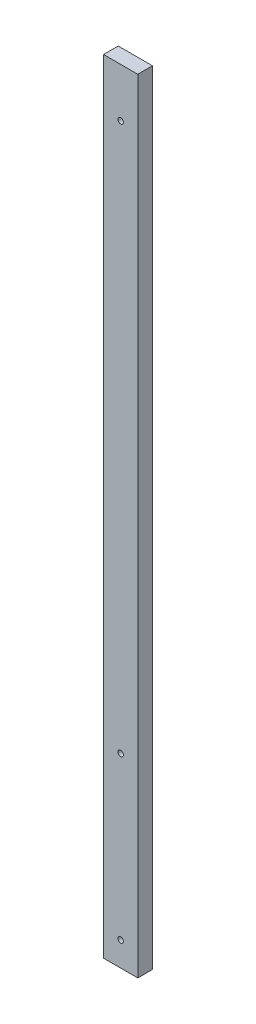
ISO-10303-21;
HEADER;
FILE_DESCRIPTION(('STEP AP214'),'2;1');
FILE_NAME('part.step','',(''),(''),'','','');
FILE_SCHEMA(('AUTOMOTIVE_DESIGN { 1 0 10303 214 1 1 1 1 }'));
ENDSEC;
DATA;
#1=APPLICATION_CONTEXT('core data for automotive mechanical design processes');
#2=APPLICATION_PROTOCOL_DEFINITION('international standard','automotive_design',2000,#1);
#3=PRODUCT_CONTEXT('',#1,'mechanical');
#4=PRODUCT('Part','Part','',(#3));
#5=PRODUCT_RELATED_PRODUCT_CATEGORY('part','',(#4));
#6=PRODUCT_DEFINITION_FORMATION('','',#4);
#7=PRODUCT_DEFINITION_CONTEXT('part definition',#1,'design');
#8=PRODUCT_DEFINITION('design','',#6,#7);
#9=PRODUCT_DEFINITION_SHAPE('','',#8);
#10=(LENGTH_UNIT() NAMED_UNIT(*) SI_UNIT(.MILLI.,.METRE.));
#11=(NAMED_UNIT(*) PLANE_ANGLE_UNIT() SI_UNIT($,.RADIAN.));
#12=(NAMED_UNIT(*) SI_UNIT($,.STERADIAN.) SOLID_ANGLE_UNIT());
#13=UNCERTAINTY_MEASURE_WITH_UNIT(LENGTH_MEASURE(1.E-05),#10,'distance_accuracy_value','');
#14=(GEOMETRIC_REPRESENTATION_CONTEXT(3) GLOBAL_UNCERTAINTY_ASSIGNED_CONTEXT((#13)) GLOBAL_UNIT_ASSIGNED_CONTEXT((#10,
#11,#12)) REPRESENTATION_CONTEXT('',''));
#15=CARTESIAN_POINT('',(0.,0.,0.));
#16=DIRECTION('',(0.,0.,1.));
#17=DIRECTION('',(1.,0.,0.));
#18=AXIS2_PLACEMENT_3D('',#15,#16,#17);
#19=CARTESIAN_POINT('',(-44.45,2032.,19.05));
#20=DIRECTION('',(-1.,0.,0.));
#21=DIRECTION('',(0.,0.,1.));
#22=AXIS2_PLACEMENT_3D('',#19,#20,#21);
#23=PLANE('',#22);
#24=DIRECTION('',(0.,0.,-1.));
#25=VECTOR('',#24,1.);
#26=CARTESIAN_POINT('',(-44.45,0.,19.05));
#27=LINE('',#26,#25);
#28=CARTESIAN_POINT('',(-44.45,0.,19.05));
#29=VERTEX_POINT('',#28);
#30=CARTESIAN_POINT('',(-44.45,0.,-19.05));
#31=VERTEX_POINT('',#30);
#32=EDGE_CURVE('E117',#29,#31,#27,.T.);
#33=ORIENTED_EDGE('',*,*,#32,.F.);
#34=DIRECTION('',(0.,-1.,0.));
#35=VECTOR('',#34,1.);
#36=CARTESIAN_POINT('',(-44.45,2032.,19.05));
#37=LINE('',#36,#35);
#38=CARTESIAN_POINT('',(-44.45,2032.,19.05));
#39=VERTEX_POINT('',#38);
#40=EDGE_CURVE('E11',#39,#29,#37,.T.);
#41=ORIENTED_EDGE('',*,*,#40,.F.);
#42=DIRECTION('',(0.,0.,-1.));
#43=VECTOR('',#42,1.);
#44=CARTESIAN_POINT('',(-44.45,2032.,19.05));
#45=LINE('',#44,#43);
#46=CARTESIAN_POINT('',(-44.45,2032.,-19.05));
#47=VERTEX_POINT('',#46);
#48=EDGE_CURVE('E108',#39,#47,#45,.T.);
#49=ORIENTED_EDGE('',*,*,#48,.T.);
#50=DIRECTION('',(0.,-1.,0.));
#51=VECTOR('',#50,1.);
#52=CARTESIAN_POINT('',(-44.45,2032.,-19.05));
#53=LINE('',#52,#51);
#54=EDGE_CURVE('E47',#47,#31,#53,.T.);
#55=ORIENTED_EDGE('',*,*,#54,.T.);
#56=EDGE_LOOP('',(#33,#41,#49,#55));
#57=FACE_BOUND('',#56,.T.);
#58=ADVANCED_FACE('F44',(#57),#23,.T.);
#59=CARTESIAN_POINT('',(-44.45,2032.,19.05));
#60=DIRECTION('',(0.,0.,-1.));
#61=DIRECTION('',(-1.,0.,0.));
#62=AXIS2_PLACEMENT_3D('',#59,#60,#61);
#63=PLANE('',#62);
#64=CARTESIAN_POINT('',(2.41071722412157E-13,63.4999999999999,19.05));
#65=DIRECTION('',(0.,0.,-1.));
#66=DIRECTION('',(-1.,0.,0.));
#67=AXIS2_PLACEMENT_3D('',#64,#65,#66);
#68=CIRCLE('',#67,7.14375);
#69=CARTESIAN_POINT('',(-7.14374999999976,63.4999999999999,19.05));
#70=VERTEX_POINT('',#69);
#71=EDGE_CURVE('E122',#70,#70,#68,.T.);
#72=ORIENTED_EDGE('',*,*,#71,.T.);
#73=EDGE_LOOP('',(#72));
#74=FACE_BOUND('',#73,.T.);
#75=CARTESIAN_POINT('',(1.89746775059891E-13,482.6,19.05));
#76=DIRECTION('',(0.,0.,-1.));
#77=DIRECTION('',(-1.,0.,0.));
#78=AXIS2_PLACEMENT_3D('',#75,#76,#77);
#79=CIRCLE('',#78,7.14375);
#80=CARTESIAN_POINT('',(-7.14374999999981,482.6,19.05));
#81=VERTEX_POINT('',#80);
#82=EDGE_CURVE('E181',#81,#81,#79,.T.);
#83=ORIENTED_EDGE('',*,*,#82,.T.);
#84=EDGE_LOOP('',(#83));
#85=FACE_BOUND('',#84,.T.);
#86=CARTESIAN_POINT('',(0.,1905.,19.05));
#87=DIRECTION('',(0.,0.,-1.));
#88=DIRECTION('',(-1.,0.,0.));
#89=AXIS2_PLACEMENT_3D('',#86,#87,#88);
#90=CIRCLE('',#89,7.14375000000004);
#91=CARTESIAN_POINT('',(-7.14375000000003,1905.,19.05));
#92=VERTEX_POINT('',#91);
#93=EDGE_CURVE('E177',#92,#92,#90,.T.);
#94=ORIENTED_EDGE('',*,*,#93,.T.);
#95=EDGE_LOOP('',(#94));
#96=FACE_BOUND('',#95,.T.);
#97=DIRECTION('',(1.,0.,0.));
#98=VECTOR('',#97,1.);
#99=CARTESIAN_POINT('',(-44.45,0.,19.05));
#100=LINE('',#99,#98);
#101=CARTESIAN_POINT('',(44.45,0.,19.05));
#102=VERTEX_POINT('',#101);
#103=EDGE_CURVE('E78',#29,#102,#100,.T.);
#104=ORIENTED_EDGE('',*,*,#103,.T.);
#105=DIRECTION('',(0.,-1.,0.));
#106=VECTOR('',#105,1.);
#107=CARTESIAN_POINT('',(44.45,2032.,19.05));
#108=LINE('',#107,#106);
#109=CARTESIAN_POINT('',(44.45,2032.,19.05));
#110=VERTEX_POINT('',#109);
#111=EDGE_CURVE('E54',#110,#102,#108,.T.);
#112=ORIENTED_EDGE('',*,*,#111,.F.);
#113=DIRECTION('',(1.,0.,0.));
#114=VECTOR('',#113,1.);
#115=CARTESIAN_POINT('',(-44.45,2032.,19.05));
#116=LINE('',#115,#114);
#117=EDGE_CURVE('E95',#39,#110,#116,.T.);
#118=ORIENTED_EDGE('',*,*,#117,.F.);
#119=ORIENTED_EDGE('',*,*,#40,.T.);
#120=EDGE_LOOP('',(#104,#112,#118,#119));
#121=FACE_BOUND('',#120,.T.);
#122=ADVANCED_FACE('F139',(#74,#85,#96,#121),#63,.F.);
#123=CARTESIAN_POINT('',(44.45,2032.,19.05));
#124=DIRECTION('',(-1.,0.,0.));
#125=DIRECTION('',(0.,0.,1.));
#126=AXIS2_PLACEMENT_3D('',#123,#124,#125);
#127=PLANE('',#126);
#128=DIRECTION('',(0.,0.,-1.));
#129=VECTOR('',#128,1.);
#130=CARTESIAN_POINT('',(44.45,0.,19.05));
#131=LINE('',#130,#129);
#132=CARTESIAN_POINT('',(44.45,0.,-19.05));
#133=VERTEX_POINT('',#132);
#134=EDGE_CURVE('E103',#102,#133,#131,.T.);
#135=ORIENTED_EDGE('',*,*,#134,.T.);
#136=DIRECTION('',(0.,-1.,0.));
#137=VECTOR('',#136,1.);
#138=CARTESIAN_POINT('',(44.45,2032.,-19.05));
#139=LINE('',#138,#137);
#140=CARTESIAN_POINT('',(44.45,2032.,-19.05));
#141=VERTEX_POINT('',#140);
#142=EDGE_CURVE('E100',#141,#133,#139,.T.);
#143=ORIENTED_EDGE('',*,*,#142,.F.);
#144=DIRECTION('',(0.,0.,-1.));
#145=VECTOR('',#144,1.);
#146=CARTESIAN_POINT('',(44.45,2032.,19.05));
#147=LINE('',#146,#145);
#148=EDGE_CURVE('E90',#110,#141,#147,.T.);
#149=ORIENTED_EDGE('',*,*,#148,.F.);
#150=ORIENTED_EDGE('',*,*,#111,.T.);
#151=EDGE_LOOP('',(#135,#143,#149,#150));
#152=FACE_BOUND('',#151,.T.);
#153=ADVANCED_FACE('F101',(#152),#127,.F.);
#154=CARTESIAN_POINT('',(-44.45,2032.,-19.05));
#155=DIRECTION('',(0.,0.,-1.));
#156=DIRECTION('',(-1.,0.,0.));
#157=AXIS2_PLACEMENT_3D('',#154,#155,#156);
#158=PLANE('',#157);
#159=CARTESIAN_POINT('',(2.41071722412157E-13,63.4999999999999,-19.05));
#160=DIRECTION('',(0.,0.,1.));
#161=DIRECTION('',(1.,0.,0.));
#162=AXIS2_PLACEMENT_3D('',#159,#160,#161);
#163=CIRCLE('',#162,7.14375);
#164=CARTESIAN_POINT('',(7.14375000000024,63.4999999999999,-19.05));
#165=VERTEX_POINT('',#164);
#166=EDGE_CURVE('E161',#165,#165,#163,.T.);
#167=ORIENTED_EDGE('',*,*,#166,.T.);
#168=EDGE_LOOP('',(#167));
#169=FACE_BOUND('',#168,.T.);
#170=CARTESIAN_POINT('',(1.89746775059891E-13,482.6,-19.05));
#171=DIRECTION('',(0.,0.,1.));
#172=DIRECTION('',(1.,0.,0.));
#173=AXIS2_PLACEMENT_3D('',#170,#171,#172);
#174=CIRCLE('',#173,7.14375);
#175=CARTESIAN_POINT('',(7.14375000000019,482.6,-19.05));
#176=VERTEX_POINT('',#175);
#177=EDGE_CURVE('E165',#176,#176,#174,.T.);
#178=ORIENTED_EDGE('',*,*,#177,.T.);
#179=EDGE_LOOP('',(#178));
#180=FACE_BOUND('',#179,.T.);
#181=CARTESIAN_POINT('',(0.,1905.,-19.05));
#182=DIRECTION('',(0.,0.,1.));
#183=DIRECTION('',(1.,0.,0.));
#184=AXIS2_PLACEMENT_3D('',#181,#182,#183);
#185=CIRCLE('',#184,7.14375000000004);
#186=CARTESIAN_POINT('',(7.14375000000006,1905.,-19.05));
#187=VERTEX_POINT('',#186);
#188=EDGE_CURVE('E168',#187,#187,#185,.T.);
#189=ORIENTED_EDGE('',*,*,#188,.T.);
#190=EDGE_LOOP('',(#189));
#191=FACE_BOUND('',#190,.T.);
#192=DIRECTION('',(1.,0.,0.));
#193=VECTOR('',#192,1.);
#194=CARTESIAN_POINT('',(-44.45,0.,-19.05));
#195=LINE('',#194,#193);
#196=EDGE_CURVE('E121',#31,#133,#195,.T.);
#197=ORIENTED_EDGE('',*,*,#196,.F.);
#198=ORIENTED_EDGE('',*,*,#54,.F.);
#199=DIRECTION('',(1.,0.,0.));
#200=VECTOR('',#199,1.);
#201=CARTESIAN_POINT('',(-44.45,2032.,-19.05));
#202=LINE('',#201,#200);
#203=EDGE_CURVE('E94',#47,#141,#202,.T.);
#204=ORIENTED_EDGE('',*,*,#203,.T.);
#205=ORIENTED_EDGE('',*,*,#142,.T.);
#206=EDGE_LOOP('',(#197,#198,#204,#205));
#207=FACE_BOUND('',#206,.T.);
#208=ADVANCED_FACE('F106',(#169,#180,#191,#207),#158,.T.);
#209=CARTESIAN_POINT('',(0.,2032.,0.));
#210=DIRECTION('',(0.,-1.,0.));
#211=DIRECTION('',(0.,0.,-1.));
#212=AXIS2_PLACEMENT_3D('',#209,#210,#211);
#213=PLANE('',#212);
#214=ORIENTED_EDGE('',*,*,#48,.F.);
#215=ORIENTED_EDGE('',*,*,#117,.T.);
#216=ORIENTED_EDGE('',*,*,#148,.T.);
#217=ORIENTED_EDGE('',*,*,#203,.F.);
#218=EDGE_LOOP('',(#214,#215,#216,#217));
#219=FACE_BOUND('',#218,.T.);
#220=ADVANCED_FACE('F93',(#219),#213,.F.);
#221=CARTESIAN_POINT('',(0.,0.,0.));
#222=DIRECTION('',(0.,-1.,0.));
#223=DIRECTION('',(0.,0.,-1.));
#224=AXIS2_PLACEMENT_3D('',#221,#222,#223);
#225=PLANE('',#224);
#226=ORIENTED_EDGE('',*,*,#32,.T.);
#227=ORIENTED_EDGE('',*,*,#196,.T.);
#228=ORIENTED_EDGE('',*,*,#134,.F.);
#229=ORIENTED_EDGE('',*,*,#103,.F.);
#230=EDGE_LOOP('',(#226,#227,#228,#229));
#231=FACE_BOUND('',#230,.T.);
#232=ADVANCED_FACE('F132',(#231),#225,.T.);
#233=CARTESIAN_POINT('',(0.,1905.,-19.05));
#234=DIRECTION('',(0.,0.,1.));
#235=DIRECTION('',(1.,0.,0.));
#236=AXIS2_PLACEMENT_3D('',#233,#234,#235);
#237=CYLINDRICAL_SURFACE('',#236,7.14375000000004);
#238=ORIENTED_EDGE('',*,*,#188,.F.);
#239=EDGE_LOOP('',(#238));
#240=FACE_BOUND('',#239,.T.);
#241=ORIENTED_EDGE('',*,*,#93,.F.);
#242=EDGE_LOOP('',(#241));
#243=FACE_BOUND('',#242,.T.);
#244=ADVANCED_FACE('F196',(#240,#243),#237,.F.);
#245=CARTESIAN_POINT('',(1.89746775059891E-13,482.6,-19.05));
#246=DIRECTION('',(0.,0.,1.));
#247=DIRECTION('',(1.,0.,0.));
#248=AXIS2_PLACEMENT_3D('',#245,#246,#247);
#249=CYLINDRICAL_SURFACE('',#248,7.14375);
#250=ORIENTED_EDGE('',*,*,#177,.F.);
#251=EDGE_LOOP('',(#250));
#252=FACE_BOUND('',#251,.T.);
#253=ORIENTED_EDGE('',*,*,#82,.F.);
#254=EDGE_LOOP('',(#253));
#255=FACE_BOUND('',#254,.T.);
#256=ADVANCED_FACE('F190',(#252,#255),#249,.F.);
#257=CARTESIAN_POINT('',(2.41071722412157E-13,63.4999999999999,-19.05));
#258=DIRECTION('',(0.,0.,1.));
#259=DIRECTION('',(1.,0.,0.));
#260=AXIS2_PLACEMENT_3D('',#257,#258,#259);
#261=CYLINDRICAL_SURFACE('',#260,7.14375);
#262=ORIENTED_EDGE('',*,*,#166,.F.);
#263=EDGE_LOOP('',(#262));
#264=FACE_BOUND('',#263,.T.);
#265=ORIENTED_EDGE('',*,*,#71,.F.);
#266=EDGE_LOOP('',(#265));
#267=FACE_BOUND('',#266,.T.);
#268=ADVANCED_FACE('F188',(#264,#267),#261,.F.);
#269=CLOSED_SHELL('',(#58,#122,#153,#208,#220,#232,#244,#256,#268));
#270=MANIFOLD_SOLID_BREP('B2',#269);
#271=ADVANCED_BREP_SHAPE_REPRESENTATION('',(#18,#270),#14);
#272=SHAPE_DEFINITION_REPRESENTATION(#9,#271);
ENDSEC;
END-ISO-10303-21;
